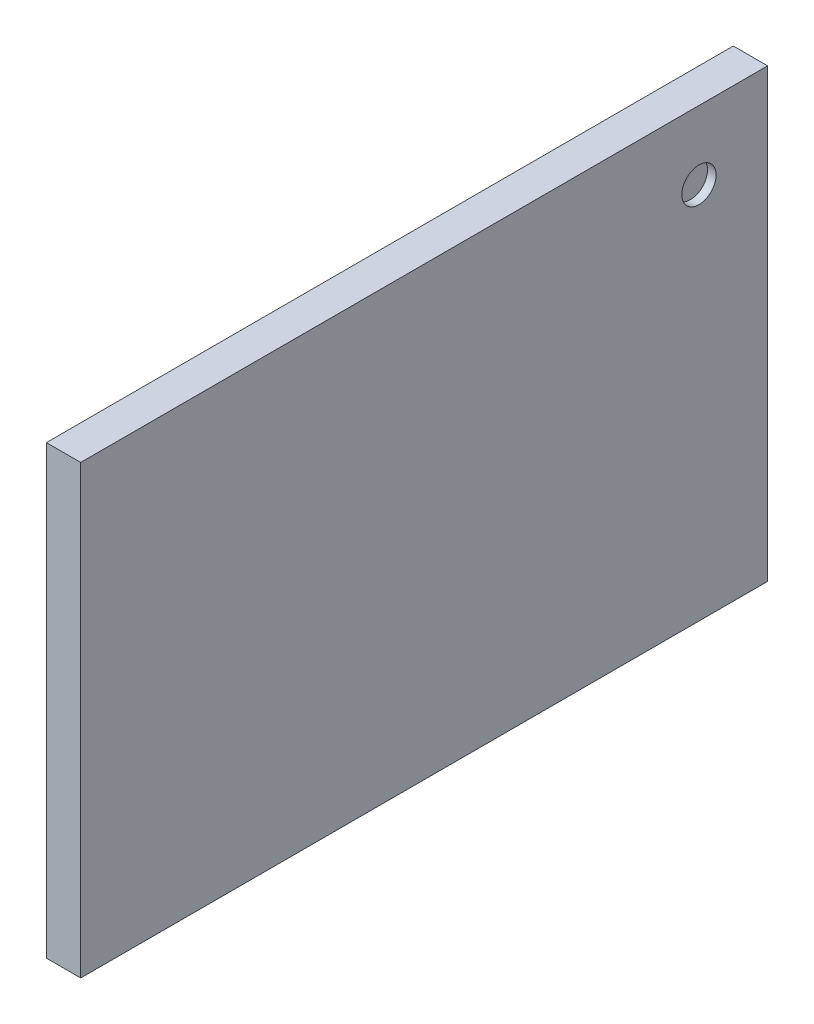
ISO-10303-21;
HEADER;
FILE_DESCRIPTION(('STEP AP214'),'2;1');
FILE_NAME('part.step','',(''),(''),'','','');
FILE_SCHEMA(('AUTOMOTIVE_DESIGN { 1 0 10303 214 1 1 1 1 }'));
ENDSEC;
DATA;
#1=APPLICATION_CONTEXT('core data for automotive mechanical design processes');
#2=APPLICATION_PROTOCOL_DEFINITION('international standard','automotive_design',2000,#1);
#3=PRODUCT_CONTEXT('',#1,'mechanical');
#4=PRODUCT('Part','Part','',(#3));
#5=PRODUCT_RELATED_PRODUCT_CATEGORY('part','',(#4));
#6=PRODUCT_DEFINITION_FORMATION('','',#4);
#7=PRODUCT_DEFINITION_CONTEXT('part definition',#1,'design');
#8=PRODUCT_DEFINITION('design','',#6,#7);
#9=PRODUCT_DEFINITION_SHAPE('','',#8);
#10=(LENGTH_UNIT() NAMED_UNIT(*) SI_UNIT(.MILLI.,.METRE.));
#11=(NAMED_UNIT(*) PLANE_ANGLE_UNIT() SI_UNIT($,.RADIAN.));
#12=(NAMED_UNIT(*) SI_UNIT($,.STERADIAN.) SOLID_ANGLE_UNIT());
#13=UNCERTAINTY_MEASURE_WITH_UNIT(LENGTH_MEASURE(1.E-05),#10,'distance_accuracy_value','');
#14=(GEOMETRIC_REPRESENTATION_CONTEXT(3) GLOBAL_UNCERTAINTY_ASSIGNED_CONTEXT((#13)) GLOBAL_UNIT_ASSIGNED_CONTEXT((#10,
#11,#12)) REPRESENTATION_CONTEXT('',''));
#15=CARTESIAN_POINT('',(0.,0.,0.));
#16=DIRECTION('',(0.,0.,1.));
#17=DIRECTION('',(1.,0.,0.));
#18=AXIS2_PLACEMENT_3D('',#15,#16,#17);
#19=CARTESIAN_POINT('',(25.4,26.8007352941176,466.818382352941));
#20=DIRECTION('',(0.,0.,-1.));
#21=DIRECTION('',(0.,1.,0.));
#22=AXIS2_PLACEMENT_3D('',#19,#20,#21);
#23=PLANE('',#22);
#24=DIRECTION('',(0.,-1.,0.));
#25=VECTOR('',#24,1.);
#26=CARTESIAN_POINT('',(0.,26.8007352941176,466.818382352941));
#27=LINE('',#26,#25);
#28=CARTESIAN_POINT('',(0.,26.8007352941176,466.818382352941));
#29=VERTEX_POINT('',#28);
#30=CARTESIAN_POINT('',(0.,-303.399264705882,466.818382352941));
#31=VERTEX_POINT('',#30);
#32=EDGE_CURVE('E111',#29,#31,#27,.T.);
#33=ORIENTED_EDGE('',*,*,#32,.T.);
#34=DIRECTION('',(-1.,0.,0.));
#35=VECTOR('',#34,1.);
#36=CARTESIAN_POINT('',(25.4,-303.399264705882,466.818382352941));
#37=LINE('',#36,#35);
#38=CARTESIAN_POINT('',(25.4,-303.399264705882,466.818382352941));
#39=VERTEX_POINT('',#38);
#40=EDGE_CURVE('E13',#39,#31,#37,.T.);
#41=ORIENTED_EDGE('',*,*,#40,.F.);
#42=DIRECTION('',(0.,-1.,0.));
#43=VECTOR('',#42,1.);
#44=CARTESIAN_POINT('',(25.4,26.8007352941176,466.818382352941));
#45=LINE('',#44,#43);
#46=CARTESIAN_POINT('',(25.4,26.8007352941176,466.818382352941));
#47=VERTEX_POINT('',#46);
#48=EDGE_CURVE('E99',#47,#39,#45,.T.);
#49=ORIENTED_EDGE('',*,*,#48,.F.);
#50=DIRECTION('',(-1.,0.,0.));
#51=VECTOR('',#50,1.);
#52=CARTESIAN_POINT('',(25.4,26.8007352941176,466.818382352941));
#53=LINE('',#52,#51);
#54=EDGE_CURVE('E107',#47,#29,#53,.T.);
#55=ORIENTED_EDGE('',*,*,#54,.T.);
#56=EDGE_LOOP('',(#33,#41,#49,#55));
#57=FACE_BOUND('',#56,.T.);
#58=ADVANCED_FACE('F48',(#57),#23,.F.);
#59=CARTESIAN_POINT('',(25.4,-303.399264705882,466.818382352941));
#60=DIRECTION('',(0.,1.,0.));
#61=DIRECTION('',(0.,0.,1.));
#62=AXIS2_PLACEMENT_3D('',#59,#60,#61);
#63=PLANE('',#62);
#64=DIRECTION('',(0.,0.,-1.));
#65=VECTOR('',#64,1.);
#66=CARTESIAN_POINT('',(0.,-303.399264705882,466.818382352941));
#67=LINE('',#66,#65);
#68=CARTESIAN_POINT('',(0.,-303.399264705882,-41.1816176470589));
#69=VERTEX_POINT('',#68);
#70=EDGE_CURVE('E103',#31,#69,#67,.T.);
#71=ORIENTED_EDGE('',*,*,#70,.T.);
#72=DIRECTION('',(-1.,0.,0.));
#73=VECTOR('',#72,1.);
#74=CARTESIAN_POINT('',(25.4,-303.399264705882,-41.1816176470589));
#75=LINE('',#74,#73);
#76=CARTESIAN_POINT('',(25.4,-303.399264705882,-41.1816176470589));
#77=VERTEX_POINT('',#76);
#78=EDGE_CURVE('E56',#77,#69,#75,.T.);
#79=ORIENTED_EDGE('',*,*,#78,.F.);
#80=DIRECTION('',(0.,0.,-1.));
#81=VECTOR('',#80,1.);
#82=CARTESIAN_POINT('',(25.4,-303.399264705882,466.818382352941));
#83=LINE('',#82,#81);
#84=EDGE_CURVE('E94',#39,#77,#83,.T.);
#85=ORIENTED_EDGE('',*,*,#84,.F.);
#86=ORIENTED_EDGE('',*,*,#40,.T.);
#87=EDGE_LOOP('',(#71,#79,#85,#86));
#88=FACE_BOUND('',#87,.T.);
#89=ADVANCED_FACE('F102',(#88),#63,.F.);
#90=CARTESIAN_POINT('',(25.4,26.8007352941176,-41.1816176470588));
#91=DIRECTION('',(0.,0.,1.));
#92=DIRECTION('',(0.,-1.,0.));
#93=AXIS2_PLACEMENT_3D('',#90,#91,#92);
#94=PLANE('',#93);
#95=DIRECTION('',(0.,1.,0.));
#96=VECTOR('',#95,1.);
#97=CARTESIAN_POINT('',(0.,26.8007352941176,-41.1816176470588));
#98=LINE('',#97,#96);
#99=CARTESIAN_POINT('',(0.,26.8007352941176,-41.1816176470588));
#100=VERTEX_POINT('',#99);
#101=EDGE_CURVE('E81',#69,#100,#98,.T.);
#102=ORIENTED_EDGE('',*,*,#101,.T.);
#103=DIRECTION('',(-1.,0.,0.));
#104=VECTOR('',#103,1.);
#105=CARTESIAN_POINT('',(25.4,26.8007352941176,-41.1816176470588));
#106=LINE('',#105,#104);
#107=CARTESIAN_POINT('',(25.4,26.8007352941176,-41.1816176470588));
#108=VERTEX_POINT('',#107);
#109=EDGE_CURVE('E104',#108,#100,#106,.T.);
#110=ORIENTED_EDGE('',*,*,#109,.F.);
#111=DIRECTION('',(0.,1.,0.));
#112=VECTOR('',#111,1.);
#113=CARTESIAN_POINT('',(25.4,26.8007352941176,-41.1816176470588));
#114=LINE('',#113,#112);
#115=EDGE_CURVE('E97',#77,#108,#114,.T.);
#116=ORIENTED_EDGE('',*,*,#115,.F.);
#117=ORIENTED_EDGE('',*,*,#78,.T.);
#118=EDGE_LOOP('',(#102,#110,#116,#117));
#119=FACE_BOUND('',#118,.T.);
#120=ADVANCED_FACE('F105',(#119),#94,.F.);
#121=CARTESIAN_POINT('',(25.4,26.8007352941176,466.818382352941));
#122=DIRECTION('',(0.,-1.,0.));
#123=DIRECTION('',(0.,0.,-1.));
#124=AXIS2_PLACEMENT_3D('',#121,#122,#123);
#125=PLANE('',#124);
#126=DIRECTION('',(0.,0.,1.));
#127=VECTOR('',#126,1.);
#128=CARTESIAN_POINT('',(0.,26.8007352941176,466.818382352941));
#129=LINE('',#128,#127);
#130=EDGE_CURVE('E87',#100,#29,#129,.T.);
#131=ORIENTED_EDGE('',*,*,#130,.T.);
#132=ORIENTED_EDGE('',*,*,#54,.F.);
#133=DIRECTION('',(0.,0.,1.));
#134=VECTOR('',#133,1.);
#135=CARTESIAN_POINT('',(25.4,26.8007352941176,466.818382352941));
#136=LINE('',#135,#134);
#137=EDGE_CURVE('E64',#108,#47,#136,.T.);
#138=ORIENTED_EDGE('',*,*,#137,.F.);
#139=ORIENTED_EDGE('',*,*,#109,.T.);
#140=EDGE_LOOP('',(#131,#132,#138,#139));
#141=FACE_BOUND('',#140,.T.);
#142=ADVANCED_FACE('F119',(#141),#125,.F.);
#143=CARTESIAN_POINT('',(25.4,0.,0.));
#144=DIRECTION('',(1.,0.,0.));
#145=DIRECTION('',(0.,0.,-1.));
#146=AXIS2_PLACEMENT_3D('',#143,#144,#145);
#147=PLANE('',#146);
#148=CARTESIAN_POINT('',(25.4,-23.9992647058824,9.61838235294114));
#149=DIRECTION('',(1.,0.,0.));
#150=DIRECTION('',(0.,0.,-1.));
#151=AXIS2_PLACEMENT_3D('',#148,#149,#150);
#152=CIRCLE('',#151,12.7);
#153=CARTESIAN_POINT('',(25.4,-23.9992647058824,-3.08161764705886));
#154=VERTEX_POINT('',#153);
#155=EDGE_CURVE('E125',#154,#154,#152,.T.);
#156=ORIENTED_EDGE('',*,*,#155,.F.);
#157=EDGE_LOOP('',(#156));
#158=FACE_BOUND('',#157,.T.);
#159=ORIENTED_EDGE('',*,*,#48,.T.);
#160=ORIENTED_EDGE('',*,*,#84,.T.);
#161=ORIENTED_EDGE('',*,*,#115,.T.);
#162=ORIENTED_EDGE('',*,*,#137,.T.);
#163=EDGE_LOOP('',(#159,#160,#161,#162));
#164=FACE_BOUND('',#163,.T.);
#165=ADVANCED_FACE('F95',(#158,#164),#147,.T.);
#166=CARTESIAN_POINT('',(0.,0.,0.));
#167=DIRECTION('',(1.,0.,0.));
#168=DIRECTION('',(0.,0.,-1.));
#169=AXIS2_PLACEMENT_3D('',#166,#167,#168);
#170=PLANE('',#169);
#171=ORIENTED_EDGE('',*,*,#32,.F.);
#172=ORIENTED_EDGE('',*,*,#130,.F.);
#173=ORIENTED_EDGE('',*,*,#101,.F.);
#174=ORIENTED_EDGE('',*,*,#70,.F.);
#175=EDGE_LOOP('',(#171,#172,#173,#174));
#176=FACE_BOUND('',#175,.T.);
#177=ADVANCED_FACE('F122',(#176),#170,.F.);
#178=CARTESIAN_POINT('',(19.05,-23.9992647058824,9.61838235294114));
#179=DIRECTION('',(1.,0.,0.));
#180=DIRECTION('',(0.,0.,-1.));
#181=AXIS2_PLACEMENT_3D('',#178,#179,#180);
#182=CYLINDRICAL_SURFACE('',#181,12.7);
#183=CARTESIAN_POINT('',(19.05,-23.9992647058824,9.61838235294114));
#184=DIRECTION('',(1.,0.,0.));
#185=DIRECTION('',(0.,0.,-1.));
#186=AXIS2_PLACEMENT_3D('',#183,#184,#185);
#187=CIRCLE('',#186,12.7);
#188=CARTESIAN_POINT('',(19.05,-23.9992647058824,-3.08161764705886));
#189=VERTEX_POINT('',#188);
#190=EDGE_CURVE('E114',#189,#189,#187,.T.);
#191=ORIENTED_EDGE('',*,*,#190,.F.);
#192=EDGE_LOOP('',(#191));
#193=FACE_BOUND('',#192,.T.);
#194=ORIENTED_EDGE('',*,*,#155,.T.);
#195=EDGE_LOOP('',(#194));
#196=FACE_BOUND('',#195,.T.);
#197=ADVANCED_FACE('F133',(#193,#196),#182,.F.);
#198=CARTESIAN_POINT('',(19.05,-23.9992647058824,9.61838235294114));
#199=DIRECTION('',(1.,0.,0.));
#200=DIRECTION('',(0.,0.,-1.));
#201=AXIS2_PLACEMENT_3D('',#198,#199,#200);
#202=PLANE('',#201);
#203=ORIENTED_EDGE('',*,*,#190,.T.);
#204=EDGE_LOOP('',(#203));
#205=FACE_BOUND('',#204,.T.);
#206=ADVANCED_FACE('F131',(#205),#202,.T.);
#207=CLOSED_SHELL('',(#58,#89,#120,#142,#165,#177,#197,#206));
#208=MANIFOLD_SOLID_BREP('B2',#207);
#209=ADVANCED_BREP_SHAPE_REPRESENTATION('',(#18,#208),#14);
#210=SHAPE_DEFINITION_REPRESENTATION(#9,#209);
ENDSEC;
END-ISO-10303-21;
